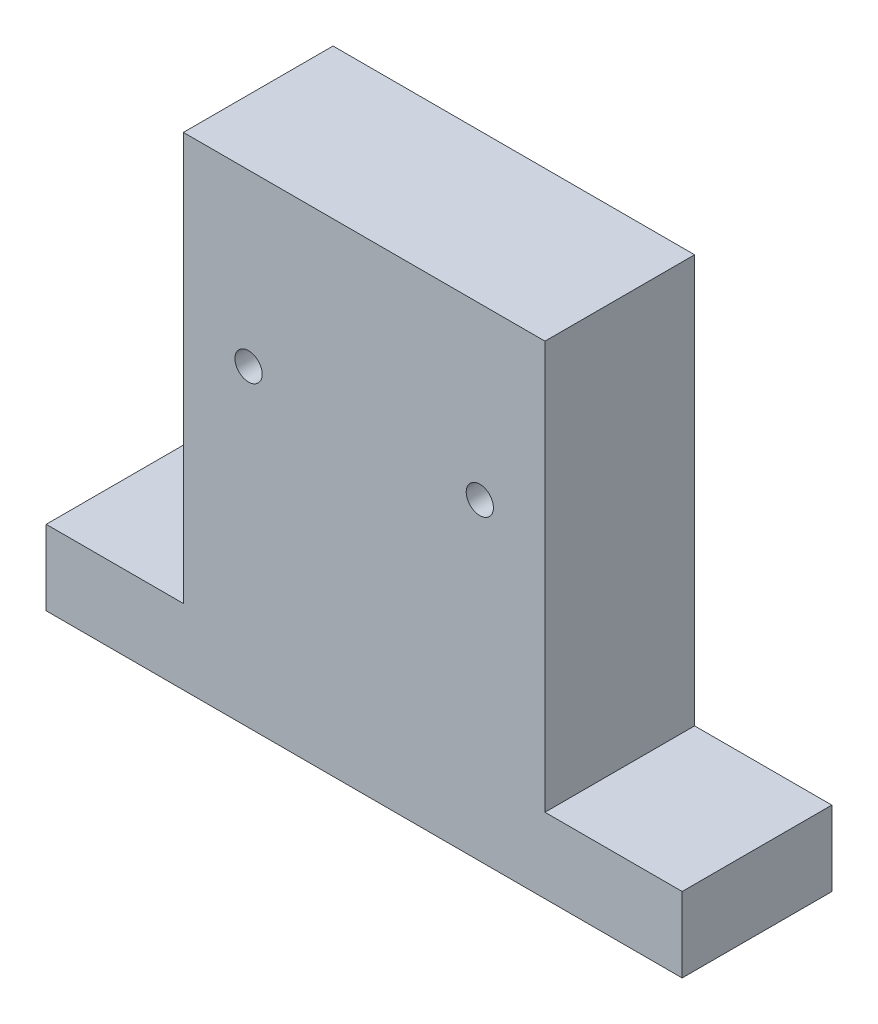
ISO-10303-21;
HEADER;
FILE_DESCRIPTION(('STEP AP214'),'2;1');
FILE_NAME('part.step','',(''),(''),'','','');
FILE_SCHEMA(('AUTOMOTIVE_DESIGN { 1 0 10303 214 1 1 1 1 }'));
ENDSEC;
DATA;
#1=APPLICATION_CONTEXT('core data for automotive mechanical design processes');
#2=APPLICATION_PROTOCOL_DEFINITION('international standard','automotive_design',2000,#1);
#3=PRODUCT_CONTEXT('',#1,'mechanical');
#4=PRODUCT('Part','Part','',(#3));
#5=PRODUCT_RELATED_PRODUCT_CATEGORY('part','',(#4));
#6=PRODUCT_DEFINITION_FORMATION('','',#4);
#7=PRODUCT_DEFINITION_CONTEXT('part definition',#1,'design');
#8=PRODUCT_DEFINITION('design','',#6,#7);
#9=PRODUCT_DEFINITION_SHAPE('','',#8);
#10=(LENGTH_UNIT() NAMED_UNIT(*) SI_UNIT(.MILLI.,.METRE.));
#11=(NAMED_UNIT(*) PLANE_ANGLE_UNIT() SI_UNIT($,.RADIAN.));
#12=(NAMED_UNIT(*) SI_UNIT($,.STERADIAN.) SOLID_ANGLE_UNIT());
#13=UNCERTAINTY_MEASURE_WITH_UNIT(LENGTH_MEASURE(1.E-05),#10,'distance_accuracy_value','');
#14=(GEOMETRIC_REPRESENTATION_CONTEXT(3) GLOBAL_UNCERTAINTY_ASSIGNED_CONTEXT((#13)) GLOBAL_UNIT_ASSIGNED_CONTEXT((#10,
#11,#12)) REPRESENTATION_CONTEXT('',''));
#15=CARTESIAN_POINT('',(0.,0.,0.));
#16=DIRECTION('',(0.,0.,1.));
#17=DIRECTION('',(1.,0.,0.));
#18=AXIS2_PLACEMENT_3D('',#15,#16,#17);
#19=CARTESIAN_POINT('',(0.,-46.4042567712497,44.));
#20=DIRECTION('',(0.,1.,0.));
#21=DIRECTION('',(0.,0.,1.));
#22=AXIS2_PLACEMENT_3D('',#19,#20,#21);
#23=PLANE('',#22);
#24=DIRECTION('',(1.,0.,0.));
#25=VECTOR('',#24,1.);
#26=CARTESIAN_POINT('',(0.,-46.4042567712497,0.));
#27=LINE('',#26,#25);
#28=CARTESIAN_POINT('',(46.6737072274759,-46.4042567712497,0.));
#29=VERTEX_POINT('',#28);
#30=CARTESIAN_POINT('',(87.0161220231711,-46.4042567712497,0.));
#31=VERTEX_POINT('',#30);
#32=EDGE_CURVE('E135',#29,#31,#27,.T.);
#33=ORIENTED_EDGE('',*,*,#32,.F.);
#34=DIRECTION('',(0.,0.,-1.));
#35=VECTOR('',#34,1.);
#36=CARTESIAN_POINT('',(46.6737072274759,-46.4042567712497,44.));
#37=LINE('',#36,#35);
#38=CARTESIAN_POINT('',(46.6737072274759,-46.4042567712497,44.));
#39=VERTEX_POINT('',#38);
#40=EDGE_CURVE('E11',#39,#29,#37,.T.);
#41=ORIENTED_EDGE('',*,*,#40,.F.);
#42=DIRECTION('',(1.,0.,0.));
#43=VECTOR('',#42,1.);
#44=CARTESIAN_POINT('',(0.,-46.4042567712497,44.));
#45=LINE('',#44,#43);
#46=CARTESIAN_POINT('',(87.0161220231711,-46.4042567712497,44.));
#47=VERTEX_POINT('',#46);
#48=EDGE_CURVE('E160',#39,#47,#45,.T.);
#49=ORIENTED_EDGE('',*,*,#48,.T.);
#50=DIRECTION('',(0.,0.,-1.));
#51=VECTOR('',#50,1.);
#52=CARTESIAN_POINT('',(87.0161220231711,-46.4042567712497,44.));
#53=LINE('',#52,#51);
#54=EDGE_CURVE('E49',#47,#31,#53,.T.);
#55=ORIENTED_EDGE('',*,*,#54,.T.);
#56=EDGE_LOOP('',(#33,#41,#49,#55));
#57=FACE_BOUND('',#56,.T.);
#58=ADVANCED_FACE('F33',(#57),#23,.T.);
#59=CARTESIAN_POINT('',(46.6737072274759,0.,44.));
#60=DIRECTION('',(-1.,0.,0.));
#61=DIRECTION('',(0.,-1.,0.));
#62=AXIS2_PLACEMENT_3D('',#59,#60,#61);
#63=PLANE('',#62);
#64=DIRECTION('',(0.,1.,0.));
#65=VECTOR('',#64,1.);
#66=CARTESIAN_POINT('',(46.6737072274759,0.,0.));
#67=LINE('',#66,#65);
#68=CARTESIAN_POINT('',(46.6737072274759,73.5627108398494,0.));
#69=VERTEX_POINT('',#68);
#70=EDGE_CURVE('E137',#29,#69,#67,.T.);
#71=ORIENTED_EDGE('',*,*,#70,.T.);
#72=DIRECTION('',(0.,0.,-1.));
#73=VECTOR('',#72,1.);
#74=CARTESIAN_POINT('',(46.6737072274759,73.5627108398494,44.));
#75=LINE('',#74,#73);
#76=CARTESIAN_POINT('',(46.6737072274759,73.5627108398494,44.));
#77=VERTEX_POINT('',#76);
#78=EDGE_CURVE('E41',#77,#69,#75,.T.);
#79=ORIENTED_EDGE('',*,*,#78,.F.);
#80=DIRECTION('',(0.,1.,0.));
#81=VECTOR('',#80,1.);
#82=CARTESIAN_POINT('',(46.6737072274759,0.,44.));
#83=LINE('',#82,#81);
#84=EDGE_CURVE('E186',#39,#77,#83,.T.);
#85=ORIENTED_EDGE('',*,*,#84,.F.);
#86=ORIENTED_EDGE('',*,*,#40,.T.);
#87=EDGE_LOOP('',(#71,#79,#85,#86));
#88=FACE_BOUND('',#87,.T.);
#89=ADVANCED_FACE('F176',(#88),#63,.F.);
#90=CARTESIAN_POINT('',(0.,73.5627108398494,44.));
#91=DIRECTION('',(0.,1.,0.));
#92=DIRECTION('',(0.,0.,1.));
#93=AXIS2_PLACEMENT_3D('',#90,#91,#92);
#94=PLANE('',#93);
#95=DIRECTION('',(1.,0.,0.));
#96=VECTOR('',#95,1.);
#97=CARTESIAN_POINT('',(0.,73.5627108398494,0.));
#98=LINE('',#97,#96);
#99=CARTESIAN_POINT('',(-59.6414631811336,73.5627108398494,0.));
#100=VERTEX_POINT('',#99);
#101=EDGE_CURVE('E140',#100,#69,#98,.T.);
#102=ORIENTED_EDGE('',*,*,#101,.F.);
#103=DIRECTION('',(0.,0.,-1.));
#104=VECTOR('',#103,1.);
#105=CARTESIAN_POINT('',(-59.6414631811336,73.5627108398494,44.));
#106=LINE('',#105,#104);
#107=CARTESIAN_POINT('',(-59.6414631811336,73.5627108398494,44.));
#108=VERTEX_POINT('',#107);
#109=EDGE_CURVE('E166',#108,#100,#106,.T.);
#110=ORIENTED_EDGE('',*,*,#109,.F.);
#111=DIRECTION('',(1.,0.,0.));
#112=VECTOR('',#111,1.);
#113=CARTESIAN_POINT('',(0.,73.5627108398494,44.));
#114=LINE('',#113,#112);
#115=EDGE_CURVE('E173',#108,#77,#114,.T.);
#116=ORIENTED_EDGE('',*,*,#115,.T.);
#117=ORIENTED_EDGE('',*,*,#78,.T.);
#118=EDGE_LOOP('',(#102,#110,#116,#117));
#119=FACE_BOUND('',#118,.T.);
#120=ADVANCED_FACE('F171',(#119),#94,.T.);
#121=CARTESIAN_POINT('',(-59.6414631811336,0.,44.));
#122=DIRECTION('',(-1.,0.,0.));
#123=DIRECTION('',(0.,-1.,0.));
#124=AXIS2_PLACEMENT_3D('',#121,#122,#123);
#125=PLANE('',#124);
#126=DIRECTION('',(0.,1.,0.));
#127=VECTOR('',#126,1.);
#128=CARTESIAN_POINT('',(-59.6414631811336,0.,0.));
#129=LINE('',#128,#127);
#130=CARTESIAN_POINT('',(-59.6414631811336,-46.4042567712497,0.));
#131=VERTEX_POINT('',#130);
#132=EDGE_CURVE('E143',#131,#100,#129,.T.);
#133=ORIENTED_EDGE('',*,*,#132,.F.);
#134=DIRECTION('',(0.,0.,-1.));
#135=VECTOR('',#134,1.);
#136=CARTESIAN_POINT('',(-59.6414631811336,-46.4042567712497,44.));
#137=LINE('',#136,#135);
#138=CARTESIAN_POINT('',(-59.6414631811336,-46.4042567712497,44.));
#139=VERTEX_POINT('',#138);
#140=EDGE_CURVE('E164',#139,#131,#137,.T.);
#141=ORIENTED_EDGE('',*,*,#140,.F.);
#142=DIRECTION('',(0.,1.,0.));
#143=VECTOR('',#142,1.);
#144=CARTESIAN_POINT('',(-59.6414631811336,0.,44.));
#145=LINE('',#144,#143);
#146=EDGE_CURVE('E185',#139,#108,#145,.T.);
#147=ORIENTED_EDGE('',*,*,#146,.T.);
#148=ORIENTED_EDGE('',*,*,#109,.T.);
#149=EDGE_LOOP('',(#133,#141,#147,#148));
#150=FACE_BOUND('',#149,.T.);
#151=ADVANCED_FACE('F183',(#150),#125,.T.);
#152=CARTESIAN_POINT('',(0.,-46.4042567712497,44.));
#153=DIRECTION('',(0.,-1.,0.));
#154=DIRECTION('',(0.,0.,-1.));
#155=AXIS2_PLACEMENT_3D('',#152,#153,#154);
#156=PLANE('',#155);
#157=DIRECTION('',(-1.,0.,0.));
#158=VECTOR('',#157,1.);
#159=CARTESIAN_POINT('',(0.,-46.4042567712497,0.));
#160=LINE('',#159,#158);
#161=CARTESIAN_POINT('',(-99.9838779768288,-46.4042567712497,0.));
#162=VERTEX_POINT('',#161);
#163=EDGE_CURVE('E146',#131,#162,#160,.T.);
#164=ORIENTED_EDGE('',*,*,#163,.T.);
#165=DIRECTION('',(0.,0.,-1.));
#166=VECTOR('',#165,1.);
#167=CARTESIAN_POINT('',(-99.9838779768288,-46.4042567712497,44.));
#168=LINE('',#167,#166);
#169=CARTESIAN_POINT('',(-99.9838779768288,-46.4042567712497,44.));
#170=VERTEX_POINT('',#169);
#171=EDGE_CURVE('E121',#170,#162,#168,.T.);
#172=ORIENTED_EDGE('',*,*,#171,.F.);
#173=DIRECTION('',(-1.,0.,0.));
#174=VECTOR('',#173,1.);
#175=CARTESIAN_POINT('',(0.,-46.4042567712497,44.));
#176=LINE('',#175,#174);
#177=EDGE_CURVE('E109',#139,#170,#176,.T.);
#178=ORIENTED_EDGE('',*,*,#177,.F.);
#179=ORIENTED_EDGE('',*,*,#140,.T.);
#180=EDGE_LOOP('',(#164,#172,#178,#179));
#181=FACE_BOUND('',#180,.T.);
#182=ADVANCED_FACE('F216',(#181),#156,.F.);
#183=CARTESIAN_POINT('',(-99.9838779768288,0.,44.));
#184=DIRECTION('',(1.,0.,0.));
#185=DIRECTION('',(0.,0.,-1.));
#186=AXIS2_PLACEMENT_3D('',#183,#184,#185);
#187=PLANE('',#186);
#188=DIRECTION('',(0.,-1.,0.));
#189=VECTOR('',#188,1.);
#190=CARTESIAN_POINT('',(-99.9838779768288,0.,0.));
#191=LINE('',#190,#189);
#192=CARTESIAN_POINT('',(-99.9838779768288,-68.4372891601505,0.));
#193=VERTEX_POINT('',#192);
#194=EDGE_CURVE('E118',#162,#193,#191,.T.);
#195=ORIENTED_EDGE('',*,*,#194,.T.);
#196=DIRECTION('',(0.,0.,-1.));
#197=VECTOR('',#196,1.);
#198=CARTESIAN_POINT('',(-99.9838779768288,-68.4372891601505,44.));
#199=LINE('',#198,#197);
#200=CARTESIAN_POINT('',(-99.9838779768288,-68.4372891601505,44.));
#201=VERTEX_POINT('',#200);
#202=EDGE_CURVE('E115',#201,#193,#199,.T.);
#203=ORIENTED_EDGE('',*,*,#202,.F.);
#204=DIRECTION('',(0.,-1.,0.));
#205=VECTOR('',#204,1.);
#206=CARTESIAN_POINT('',(-99.9838779768288,0.,44.));
#207=LINE('',#206,#205);
#208=EDGE_CURVE('E99',#170,#201,#207,.T.);
#209=ORIENTED_EDGE('',*,*,#208,.F.);
#210=ORIENTED_EDGE('',*,*,#171,.T.);
#211=EDGE_LOOP('',(#195,#203,#209,#210));
#212=FACE_BOUND('',#211,.T.);
#213=ADVANCED_FACE('F116',(#212),#187,.F.);
#214=CARTESIAN_POINT('',(0.,-68.4372891601505,44.));
#215=DIRECTION('',(0.,1.,0.));
#216=DIRECTION('',(0.,0.,1.));
#217=AXIS2_PLACEMENT_3D('',#214,#215,#216);
#218=PLANE('',#217);
#219=DIRECTION('',(1.,0.,0.));
#220=VECTOR('',#219,1.);
#221=CARTESIAN_POINT('',(0.,-68.4372891601505,0.));
#222=LINE('',#221,#220);
#223=CARTESIAN_POINT('',(87.0161220231712,-68.4372891601505,0.));
#224=VERTEX_POINT('',#223);
#225=EDGE_CURVE('E149',#193,#224,#222,.T.);
#226=ORIENTED_EDGE('',*,*,#225,.T.);
#227=DIRECTION('',(0.,0.,-1.));
#228=VECTOR('',#227,1.);
#229=CARTESIAN_POINT('',(87.0161220231712,-68.4372891601505,44.));
#230=LINE('',#229,#228);
#231=CARTESIAN_POINT('',(87.0161220231712,-68.4372891601505,44.));
#232=VERTEX_POINT('',#231);
#233=EDGE_CURVE('E75',#232,#224,#230,.T.);
#234=ORIENTED_EDGE('',*,*,#233,.F.);
#235=DIRECTION('',(1.,0.,0.));
#236=VECTOR('',#235,1.);
#237=CARTESIAN_POINT('',(0.,-68.4372891601505,44.));
#238=LINE('',#237,#236);
#239=EDGE_CURVE('E106',#201,#232,#238,.T.);
#240=ORIENTED_EDGE('',*,*,#239,.F.);
#241=ORIENTED_EDGE('',*,*,#202,.T.);
#242=EDGE_LOOP('',(#226,#234,#240,#241));
#243=FACE_BOUND('',#242,.T.);
#244=ADVANCED_FACE('F123',(#243),#218,.F.);
#245=CARTESIAN_POINT('',(-40.4838779768289,23.5627108398494,44.));
#246=DIRECTION('',(0.,0.,-1.));
#247=DIRECTION('',(-1.,0.,0.));
#248=AXIS2_PLACEMENT_3D('',#245,#246,#247);
#249=CYLINDRICAL_SURFACE('',#248,4.00000000000001);
#250=CARTESIAN_POINT('',(-40.4838779768289,23.5627108398494,44.));
#251=DIRECTION('',(0.,0.,1.));
#252=DIRECTION('',(1.,0.,0.));
#253=AXIS2_PLACEMENT_3D('',#250,#251,#252);
#254=CIRCLE('',#253,4.00000000000001);
#255=CARTESIAN_POINT('',(-36.4838779768289,23.5627108398494,44.));
#256=VERTEX_POINT('',#255);
#257=EDGE_CURVE('E126',#256,#256,#254,.T.);
#258=ORIENTED_EDGE('',*,*,#257,.T.);
#259=EDGE_LOOP('',(#258));
#260=FACE_BOUND('',#259,.T.);
#261=CARTESIAN_POINT('',(-40.4838779768289,23.5627108398494,0.));
#262=DIRECTION('',(0.,0.,1.));
#263=DIRECTION('',(1.,0.,0.));
#264=AXIS2_PLACEMENT_3D('',#261,#262,#263);
#265=CIRCLE('',#264,4.00000000000001);
#266=CARTESIAN_POINT('',(-36.4838779768289,23.5627108398494,0.));
#267=VERTEX_POINT('',#266);
#268=EDGE_CURVE('E154',#267,#267,#265,.T.);
#269=ORIENTED_EDGE('',*,*,#268,.F.);
#270=EDGE_LOOP('',(#269));
#271=FACE_BOUND('',#270,.T.);
#272=ADVANCED_FACE('F194',(#260,#271),#249,.F.);
#273=CARTESIAN_POINT('',(87.0161220231711,1.09616439170197E-13,44.));
#274=DIRECTION('',(1.,0.,0.));
#275=DIRECTION('',(0.,1.,0.));
#276=AXIS2_PLACEMENT_3D('',#273,#274,#275);
#277=PLANE('',#276);
#278=DIRECTION('',(0.,-1.,0.));
#279=VECTOR('',#278,1.);
#280=CARTESIAN_POINT('',(87.0161220231711,1.09616439170197E-13,0.));
#281=LINE('',#280,#279);
#282=EDGE_CURVE('E151',#31,#224,#281,.T.);
#283=ORIENTED_EDGE('',*,*,#282,.F.);
#284=ORIENTED_EDGE('',*,*,#54,.F.);
#285=DIRECTION('',(0.,-1.,0.));
#286=VECTOR('',#285,1.);
#287=CARTESIAN_POINT('',(87.0161220231711,1.09616439170197E-13,44.));
#288=LINE('',#287,#286);
#289=EDGE_CURVE('E124',#47,#232,#288,.T.);
#290=ORIENTED_EDGE('',*,*,#289,.T.);
#291=ORIENTED_EDGE('',*,*,#233,.T.);
#292=EDGE_LOOP('',(#283,#284,#290,#291));
#293=FACE_BOUND('',#292,.T.);
#294=ADVANCED_FACE('F191',(#293),#277,.T.);
#295=CARTESIAN_POINT('',(27.5161220231711,23.5627108398494,44.));
#296=DIRECTION('',(0.,0.,-1.));
#297=DIRECTION('',(-1.,0.,0.));
#298=AXIS2_PLACEMENT_3D('',#295,#296,#297);
#299=CYLINDRICAL_SURFACE('',#298,4.);
#300=CARTESIAN_POINT('',(27.5161220231711,23.5627108398494,44.));
#301=DIRECTION('',(0.,0.,1.));
#302=DIRECTION('',(1.,0.,0.));
#303=AXIS2_PLACEMENT_3D('',#300,#301,#302);
#304=CIRCLE('',#303,4.);
#305=CARTESIAN_POINT('',(31.5161220231711,23.5627108398494,44.));
#306=VERTEX_POINT('',#305);
#307=EDGE_CURVE('E132',#306,#306,#304,.F.);
#308=ORIENTED_EDGE('',*,*,#307,.F.);
#309=EDGE_LOOP('',(#308));
#310=FACE_BOUND('',#309,.T.);
#311=CARTESIAN_POINT('',(27.5161220231711,23.5627108398494,0.));
#312=DIRECTION('',(0.,0.,1.));
#313=DIRECTION('',(1.,0.,0.));
#314=AXIS2_PLACEMENT_3D('',#311,#312,#313);
#315=CIRCLE('',#314,4.);
#316=CARTESIAN_POINT('',(31.5161220231711,23.5627108398494,0.));
#317=VERTEX_POINT('',#316);
#318=EDGE_CURVE('E157',#317,#317,#315,.F.);
#319=ORIENTED_EDGE('',*,*,#318,.T.);
#320=EDGE_LOOP('',(#319));
#321=FACE_BOUND('',#320,.T.);
#322=ADVANCED_FACE('F193',(#310,#321),#299,.F.);
#323=CARTESIAN_POINT('',(0.,0.,44.));
#324=DIRECTION('',(0.,0.,1.));
#325=DIRECTION('',(1.,0.,0.));
#326=AXIS2_PLACEMENT_3D('',#323,#324,#325);
#327=PLANE('',#326);
#328=ORIENTED_EDGE('',*,*,#48,.F.);
#329=ORIENTED_EDGE('',*,*,#84,.T.);
#330=ORIENTED_EDGE('',*,*,#115,.F.);
#331=ORIENTED_EDGE('',*,*,#146,.F.);
#332=ORIENTED_EDGE('',*,*,#177,.T.);
#333=ORIENTED_EDGE('',*,*,#208,.T.);
#334=ORIENTED_EDGE('',*,*,#239,.T.);
#335=ORIENTED_EDGE('',*,*,#289,.F.);
#336=EDGE_LOOP('',(#328,#329,#330,#331,#332,#333,#334,#335));
#337=FACE_BOUND('',#336,.T.);
#338=ORIENTED_EDGE('',*,*,#257,.F.);
#339=EDGE_LOOP('',(#338));
#340=FACE_BOUND('',#339,.T.);
#341=ORIENTED_EDGE('',*,*,#307,.T.);
#342=EDGE_LOOP('',(#341));
#343=FACE_BOUND('',#342,.T.);
#344=ADVANCED_FACE('F102',(#337,#340,#343),#327,.T.);
#345=CARTESIAN_POINT('',(0.,0.,0.));
#346=DIRECTION('',(0.,0.,1.));
#347=DIRECTION('',(1.,0.,0.));
#348=AXIS2_PLACEMENT_3D('',#345,#346,#347);
#349=PLANE('',#348);
#350=ORIENTED_EDGE('',*,*,#32,.T.);
#351=ORIENTED_EDGE('',*,*,#282,.T.);
#352=ORIENTED_EDGE('',*,*,#225,.F.);
#353=ORIENTED_EDGE('',*,*,#194,.F.);
#354=ORIENTED_EDGE('',*,*,#163,.F.);
#355=ORIENTED_EDGE('',*,*,#132,.T.);
#356=ORIENTED_EDGE('',*,*,#101,.T.);
#357=ORIENTED_EDGE('',*,*,#70,.F.);
#358=EDGE_LOOP('',(#350,#351,#352,#353,#354,#355,#356,#357));
#359=FACE_BOUND('',#358,.T.);
#360=ORIENTED_EDGE('',*,*,#268,.T.);
#361=EDGE_LOOP('',(#360));
#362=FACE_BOUND('',#361,.T.);
#363=ORIENTED_EDGE('',*,*,#318,.F.);
#364=EDGE_LOOP('',(#363));
#365=FACE_BOUND('',#364,.T.);
#366=ADVANCED_FACE('F178',(#359,#362,#365),#349,.F.);
#367=CLOSED_SHELL('',(#58,#89,#120,#151,#182,#213,#244,#272,#294,#322,#344,#366));
#368=MANIFOLD_SOLID_BREP('B2',#367);
#369=ADVANCED_BREP_SHAPE_REPRESENTATION('',(#18,#368),#14);
#370=SHAPE_DEFINITION_REPRESENTATION(#9,#369);
ENDSEC;
END-ISO-10303-21;
